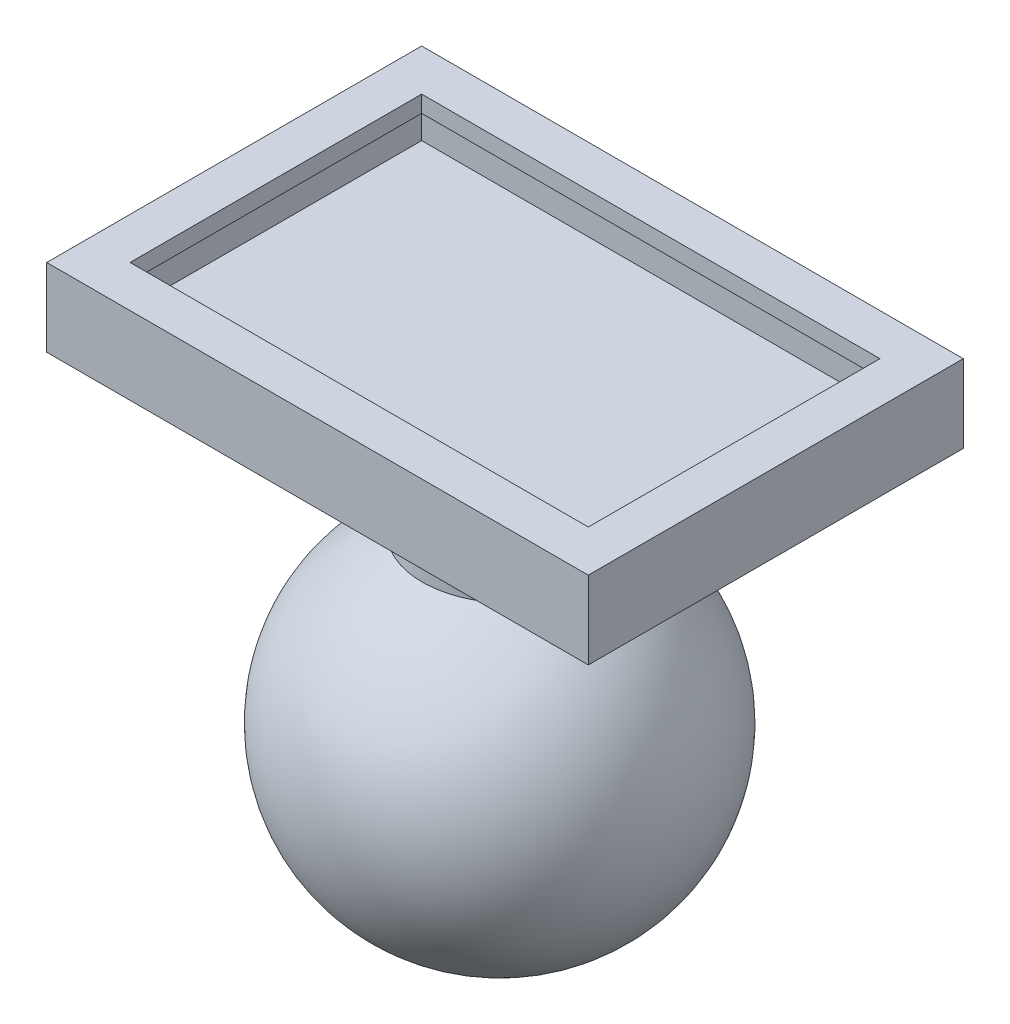
ISO-10303-21;
HEADER;
FILE_DESCRIPTION(('STEP AP214'),'2;1');
FILE_NAME('part.step','',(''),(''),'','','');
FILE_SCHEMA(('AUTOMOTIVE_DESIGN { 1 0 10303 214 1 1 1 1 }'));
ENDSEC;
DATA;
#1=APPLICATION_CONTEXT('core data for automotive mechanical design processes');
#2=APPLICATION_PROTOCOL_DEFINITION('international standard','automotive_design',2000,#1);
#3=PRODUCT_CONTEXT('',#1,'mechanical');
#4=PRODUCT('Part','Part','',(#3));
#5=PRODUCT_RELATED_PRODUCT_CATEGORY('part','',(#4));
#6=PRODUCT_DEFINITION_FORMATION('','',#4);
#7=PRODUCT_DEFINITION_CONTEXT('part definition',#1,'design');
#8=PRODUCT_DEFINITION('design','',#6,#7);
#9=PRODUCT_DEFINITION_SHAPE('','',#8);
#10=(LENGTH_UNIT() NAMED_UNIT(*) SI_UNIT(.MILLI.,.METRE.));
#11=(NAMED_UNIT(*) PLANE_ANGLE_UNIT() SI_UNIT($,.RADIAN.));
#12=(NAMED_UNIT(*) SI_UNIT($,.STERADIAN.) SOLID_ANGLE_UNIT());
#13=UNCERTAINTY_MEASURE_WITH_UNIT(LENGTH_MEASURE(1.E-05),#10,'distance_accuracy_value','');
#14=(GEOMETRIC_REPRESENTATION_CONTEXT(3) GLOBAL_UNCERTAINTY_ASSIGNED_CONTEXT((#13)) GLOBAL_UNIT_ASSIGNED_CONTEXT((#10,
#11,#12)) REPRESENTATION_CONTEXT('',''));
#15=CARTESIAN_POINT('',(0.,0.,0.));
#16=DIRECTION('',(0.,0.,1.));
#17=DIRECTION('',(1.,0.,0.));
#18=AXIS2_PLACEMENT_3D('',#15,#16,#17);
#19=CARTESIAN_POINT('',(0.,-4.4,0.));
#20=DIRECTION('',(0.,-1.,0.));
#21=DIRECTION('',(0.,0.,-1.));
#22=AXIS2_PLACEMENT_3D('',#19,#20,#21);
#23=PLANE('',#22);
#24=DIRECTION('',(0.,0.,-1.));
#25=VECTOR('',#24,1.);
#26=CARTESIAN_POINT('',(-2.99999999999999,-4.4,3.));
#27=LINE('',#26,#25);
#28=CARTESIAN_POINT('',(-2.99999999999999,-4.4,3.));
#29=VERTEX_POINT('',#28);
#30=CARTESIAN_POINT('',(-2.99999999999999,-4.4,-24.));
#31=VERTEX_POINT('',#30);
#32=EDGE_CURVE('E135',#29,#31,#27,.T.);
#33=ORIENTED_EDGE('',*,*,#32,.T.);
#34=DIRECTION('',(1.,0.,0.));
#35=VECTOR('',#34,1.);
#36=CARTESIAN_POINT('',(-2.99999999999999,-4.4,-24.));
#37=LINE('',#36,#35);
#38=CARTESIAN_POINT('',(36.,-4.4,-24.));
#39=VERTEX_POINT('',#38);
#40=EDGE_CURVE('E144',#31,#39,#37,.T.);
#41=ORIENTED_EDGE('',*,*,#40,.T.);
#42=DIRECTION('',(0.,0.,1.));
#43=VECTOR('',#42,1.);
#44=CARTESIAN_POINT('',(36.,-4.4,3.));
#45=LINE('',#44,#43);
#46=CARTESIAN_POINT('',(36.,-4.4,3.));
#47=VERTEX_POINT('',#46);
#48=EDGE_CURVE('E150',#39,#47,#45,.T.);
#49=ORIENTED_EDGE('',*,*,#48,.T.);
#50=DIRECTION('',(-1.,0.,0.));
#51=VECTOR('',#50,1.);
#52=CARTESIAN_POINT('',(-2.99999999999999,-4.4,3.));
#53=LINE('',#52,#51);
#54=EDGE_CURVE('E155',#47,#29,#53,.T.);
#55=ORIENTED_EDGE('',*,*,#54,.T.);
#56=EDGE_LOOP('',(#33,#41,#49,#55));
#57=FACE_BOUND('',#56,.T.);
#58=CARTESIAN_POINT('',(16.5,-4.4,-10.5));
#59=DIRECTION('',(0.,-1.,0.));
#60=DIRECTION('',(0.,0.,-1.));
#61=AXIS2_PLACEMENT_3D('',#58,#59,#60);
#62=CIRCLE('',#61,7.12302374541341);
#63=CARTESIAN_POINT('',(16.5,-4.4,-17.6230237454134));
#64=VERTEX_POINT('',#63);
#65=EDGE_CURVE('E159',#64,#64,#62,.T.);
#66=ORIENTED_EDGE('',*,*,#65,.F.);
#67=EDGE_LOOP('',(#66));
#68=FACE_BOUND('',#67,.T.);
#69=ADVANCED_FACE('F33',(#57,#68),#23,.T.);
#70=CARTESIAN_POINT('',(0.,1.2,0.));
#71=DIRECTION('',(0.,1.,0.));
#72=DIRECTION('',(0.,0.,1.));
#73=AXIS2_PLACEMENT_3D('',#70,#71,#72);
#74=PLANE('',#73);
#75=DIRECTION('',(0.,0.,1.));
#76=VECTOR('',#75,1.);
#77=CARTESIAN_POINT('',(-3.,1.2,-24.));
#78=LINE('',#77,#76);
#79=CARTESIAN_POINT('',(-3.,1.2,-24.));
#80=VERTEX_POINT('',#79);
#81=CARTESIAN_POINT('',(-2.99999999999999,1.2,3.));
#82=VERTEX_POINT('',#81);
#83=EDGE_CURVE('E137',#80,#82,#78,.T.);
#84=ORIENTED_EDGE('',*,*,#83,.T.);
#85=DIRECTION('',(1.,0.,0.));
#86=VECTOR('',#85,1.);
#87=CARTESIAN_POINT('',(-2.99999999999999,1.2,3.));
#88=LINE('',#87,#86);
#89=CARTESIAN_POINT('',(36.,1.2,3.));
#90=VERTEX_POINT('',#89);
#91=EDGE_CURVE('E226',#82,#90,#88,.T.);
#92=ORIENTED_EDGE('',*,*,#91,.T.);
#93=DIRECTION('',(0.,0.,-1.));
#94=VECTOR('',#93,1.);
#95=CARTESIAN_POINT('',(36.,1.2,-24.));
#96=LINE('',#95,#94);
#97=CARTESIAN_POINT('',(36.,1.2,-24.));
#98=VERTEX_POINT('',#97);
#99=EDGE_CURVE('E228',#90,#98,#96,.T.);
#100=ORIENTED_EDGE('',*,*,#99,.T.);
#101=DIRECTION('',(-1.,0.,0.));
#102=VECTOR('',#101,1.);
#103=CARTESIAN_POINT('',(-3.,1.2,-24.));
#104=LINE('',#103,#102);
#105=EDGE_CURVE('E141',#98,#80,#104,.T.);
#106=ORIENTED_EDGE('',*,*,#105,.T.);
#107=EDGE_LOOP('',(#84,#92,#100,#106));
#108=FACE_BOUND('',#107,.T.);
#109=DIRECTION('',(1.,0.,0.));
#110=VECTOR('',#109,1.);
#111=CARTESIAN_POINT('',(0.,1.2,0.));
#112=LINE('',#111,#110);
#113=CARTESIAN_POINT('',(0.,1.2,0.));
#114=VERTEX_POINT('',#113);
#115=CARTESIAN_POINT('',(33.,1.2,0.));
#116=VERTEX_POINT('',#115);
#117=EDGE_CURVE('E199',#114,#116,#112,.T.);
#118=ORIENTED_EDGE('',*,*,#117,.F.);
#119=DIRECTION('',(0.,0.,1.));
#120=VECTOR('',#119,1.);
#121=CARTESIAN_POINT('',(0.,1.2,0.));
#122=LINE('',#121,#120);
#123=CARTESIAN_POINT('',(0.,1.2,-21.));
#124=VERTEX_POINT('',#123);
#125=EDGE_CURVE('E197',#124,#114,#122,.T.);
#126=ORIENTED_EDGE('',*,*,#125,.F.);
#127=DIRECTION('',(-1.,0.,0.));
#128=VECTOR('',#127,1.);
#129=CARTESIAN_POINT('',(0.,1.2,-21.));
#130=LINE('',#129,#128);
#131=CARTESIAN_POINT('',(33.,1.2,-21.));
#132=VERTEX_POINT('',#131);
#133=EDGE_CURVE('E204',#132,#124,#130,.T.);
#134=ORIENTED_EDGE('',*,*,#133,.F.);
#135=DIRECTION('',(0.,0.,-1.));
#136=VECTOR('',#135,1.);
#137=CARTESIAN_POINT('',(33.,1.2,0.));
#138=LINE('',#137,#136);
#139=EDGE_CURVE('E202',#116,#132,#138,.T.);
#140=ORIENTED_EDGE('',*,*,#139,.F.);
#141=EDGE_LOOP('',(#118,#126,#134,#140));
#142=FACE_BOUND('',#141,.T.);
#143=ADVANCED_FACE('F239',(#108,#142),#74,.T.);
#144=CARTESIAN_POINT('',(0.,0.,0.));
#145=DIRECTION('',(0.,1.,0.));
#146=DIRECTION('',(0.,0.,1.));
#147=AXIS2_PLACEMENT_3D('',#144,#145,#146);
#148=PLANE('',#147);
#149=DIRECTION('',(-1.,0.,0.));
#150=VECTOR('',#149,1.);
#151=CARTESIAN_POINT('',(-1.5,0.,1.5));
#152=LINE('',#151,#150);
#153=CARTESIAN_POINT('',(34.5,0.,1.5));
#154=VERTEX_POINT('',#153);
#155=CARTESIAN_POINT('',(-1.5,0.,1.5));
#156=VERTEX_POINT('',#155);
#157=EDGE_CURVE('E170',#154,#156,#152,.T.);
#158=ORIENTED_EDGE('',*,*,#157,.T.);
#159=DIRECTION('',(0.,0.,-1.));
#160=VECTOR('',#159,1.);
#161=CARTESIAN_POINT('',(-1.5,0.,1.5));
#162=LINE('',#161,#160);
#163=CARTESIAN_POINT('',(-1.5,0.,-22.5));
#164=VERTEX_POINT('',#163);
#165=EDGE_CURVE('E165',#156,#164,#162,.T.);
#166=ORIENTED_EDGE('',*,*,#165,.T.);
#167=DIRECTION('',(1.,0.,0.));
#168=VECTOR('',#167,1.);
#169=CARTESIAN_POINT('',(-1.5,0.,-22.5));
#170=LINE('',#169,#168);
#171=CARTESIAN_POINT('',(34.5,0.,-22.5));
#172=VERTEX_POINT('',#171);
#173=EDGE_CURVE('E180',#164,#172,#170,.T.);
#174=ORIENTED_EDGE('',*,*,#173,.T.);
#175=DIRECTION('',(0.,0.,1.));
#176=VECTOR('',#175,1.);
#177=CARTESIAN_POINT('',(34.5,0.,1.5));
#178=LINE('',#177,#176);
#179=EDGE_CURVE('E183',#172,#154,#178,.T.);
#180=ORIENTED_EDGE('',*,*,#179,.T.);
#181=EDGE_LOOP('',(#158,#166,#174,#180));
#182=FACE_BOUND('',#181,.T.);
#183=DIRECTION('',(0.,0.,1.));
#184=VECTOR('',#183,1.);
#185=CARTESIAN_POINT('',(0.,0.,0.));
#186=LINE('',#185,#184);
#187=CARTESIAN_POINT('',(0.,0.,-21.));
#188=VERTEX_POINT('',#187);
#189=CARTESIAN_POINT('',(0.,0.,0.));
#190=VERTEX_POINT('',#189);
#191=EDGE_CURVE('E196',#188,#190,#186,.T.);
#192=ORIENTED_EDGE('',*,*,#191,.T.);
#193=DIRECTION('',(1.,0.,0.));
#194=VECTOR('',#193,1.);
#195=CARTESIAN_POINT('',(0.,0.,0.));
#196=LINE('',#195,#194);
#197=CARTESIAN_POINT('',(33.,0.,0.));
#198=VERTEX_POINT('',#197);
#199=EDGE_CURVE('E209',#190,#198,#196,.T.);
#200=ORIENTED_EDGE('',*,*,#199,.T.);
#201=DIRECTION('',(0.,0.,-1.));
#202=VECTOR('',#201,1.);
#203=CARTESIAN_POINT('',(33.,0.,0.));
#204=LINE('',#203,#202);
#205=CARTESIAN_POINT('',(33.,0.,-21.));
#206=VERTEX_POINT('',#205);
#207=EDGE_CURVE('E212',#198,#206,#204,.T.);
#208=ORIENTED_EDGE('',*,*,#207,.T.);
#209=DIRECTION('',(-1.,0.,0.));
#210=VECTOR('',#209,1.);
#211=CARTESIAN_POINT('',(0.,0.,-21.));
#212=LINE('',#211,#210);
#213=EDGE_CURVE('E200',#206,#188,#212,.T.);
#214=ORIENTED_EDGE('',*,*,#213,.T.);
#215=EDGE_LOOP('',(#192,#200,#208,#214));
#216=FACE_BOUND('',#215,.T.);
#217=ADVANCED_FACE('F257',(#182,#216),#148,.F.);
#218=CARTESIAN_POINT('',(-3.,1.2,-24.));
#219=DIRECTION('',(1.,0.,0.));
#220=DIRECTION('',(0.,0.,-1.));
#221=AXIS2_PLACEMENT_3D('',#218,#219,#220);
#222=PLANE('',#221);
#223=DIRECTION('',(0.,-1.,0.));
#224=VECTOR('',#223,1.);
#225=CARTESIAN_POINT('',(-3.,1.2,-24.));
#226=LINE('',#225,#224);
#227=EDGE_CURVE('E130',#80,#31,#226,.T.);
#228=ORIENTED_EDGE('',*,*,#227,.T.);
#229=ORIENTED_EDGE('',*,*,#32,.F.);
#230=DIRECTION('',(0.,-1.,0.));
#231=VECTOR('',#230,1.);
#232=CARTESIAN_POINT('',(-2.99999999999999,1.2,3.));
#233=LINE('',#232,#231);
#234=EDGE_CURVE('E46',#82,#29,#233,.T.);
#235=ORIENTED_EDGE('',*,*,#234,.F.);
#236=ORIENTED_EDGE('',*,*,#83,.F.);
#237=EDGE_LOOP('',(#228,#229,#235,#236));
#238=FACE_BOUND('',#237,.T.);
#239=ADVANCED_FACE('F132',(#238),#222,.F.);
#240=CARTESIAN_POINT('',(-2.99999999999999,1.2,3.));
#241=DIRECTION('',(0.,0.,-1.));
#242=DIRECTION('',(-1.,0.,0.));
#243=AXIS2_PLACEMENT_3D('',#240,#241,#242);
#244=PLANE('',#243);
#245=ORIENTED_EDGE('',*,*,#234,.T.);
#246=ORIENTED_EDGE('',*,*,#54,.F.);
#247=DIRECTION('',(0.,-1.,0.));
#248=VECTOR('',#247,1.);
#249=CARTESIAN_POINT('',(36.,1.2,3.));
#250=LINE('',#249,#248);
#251=EDGE_CURVE('E232',#90,#47,#250,.T.);
#252=ORIENTED_EDGE('',*,*,#251,.F.);
#253=ORIENTED_EDGE('',*,*,#91,.F.);
#254=EDGE_LOOP('',(#245,#246,#252,#253));
#255=FACE_BOUND('',#254,.T.);
#256=ADVANCED_FACE('F235',(#255),#244,.F.);
#257=CARTESIAN_POINT('',(36.,1.2,-24.));
#258=DIRECTION('',(-1.,0.,0.));
#259=DIRECTION('',(0.,0.,1.));
#260=AXIS2_PLACEMENT_3D('',#257,#258,#259);
#261=PLANE('',#260);
#262=ORIENTED_EDGE('',*,*,#251,.T.);
#263=ORIENTED_EDGE('',*,*,#48,.F.);
#264=DIRECTION('',(0.,-1.,0.));
#265=VECTOR('',#264,1.);
#266=CARTESIAN_POINT('',(36.,1.2,-24.));
#267=LINE('',#266,#265);
#268=EDGE_CURVE('E140',#98,#39,#267,.T.);
#269=ORIENTED_EDGE('',*,*,#268,.F.);
#270=ORIENTED_EDGE('',*,*,#99,.F.);
#271=EDGE_LOOP('',(#262,#263,#269,#270));
#272=FACE_BOUND('',#271,.T.);
#273=ADVANCED_FACE('F242',(#272),#261,.F.);
#274=CARTESIAN_POINT('',(-3.,1.2,-24.));
#275=DIRECTION('',(0.,0.,1.));
#276=DIRECTION('',(1.,0.,0.));
#277=AXIS2_PLACEMENT_3D('',#274,#275,#276);
#278=PLANE('',#277);
#279=ORIENTED_EDGE('',*,*,#268,.T.);
#280=ORIENTED_EDGE('',*,*,#40,.F.);
#281=ORIENTED_EDGE('',*,*,#227,.F.);
#282=ORIENTED_EDGE('',*,*,#105,.F.);
#283=EDGE_LOOP('',(#279,#280,#281,#282));
#284=FACE_BOUND('',#283,.T.);
#285=ADVANCED_FACE('F145',(#284),#278,.F.);
#286=CARTESIAN_POINT('',(0.,1.2,0.));
#287=DIRECTION('',(1.,0.,0.));
#288=DIRECTION('',(0.,0.,-1.));
#289=AXIS2_PLACEMENT_3D('',#286,#287,#288);
#290=PLANE('',#289);
#291=ORIENTED_EDGE('',*,*,#191,.F.);
#292=DIRECTION('',(0.,-1.,0.));
#293=VECTOR('',#292,1.);
#294=CARTESIAN_POINT('',(0.,1.2,-21.));
#295=LINE('',#294,#293);
#296=EDGE_CURVE('E206',#124,#188,#295,.T.);
#297=ORIENTED_EDGE('',*,*,#296,.F.);
#298=ORIENTED_EDGE('',*,*,#125,.T.);
#299=DIRECTION('',(0.,-1.,0.));
#300=VECTOR('',#299,1.);
#301=CARTESIAN_POINT('',(0.,1.2,0.));
#302=LINE('',#301,#300);
#303=EDGE_CURVE('E222',#114,#190,#302,.T.);
#304=ORIENTED_EDGE('',*,*,#303,.T.);
#305=EDGE_LOOP('',(#291,#297,#298,#304));
#306=FACE_BOUND('',#305,.T.);
#307=ADVANCED_FACE('F249',(#306),#290,.T.);
#308=CARTESIAN_POINT('',(0.,1.2,0.));
#309=DIRECTION('',(0.,0.,-1.));
#310=DIRECTION('',(-1.,0.,0.));
#311=AXIS2_PLACEMENT_3D('',#308,#309,#310);
#312=PLANE('',#311);
#313=ORIENTED_EDGE('',*,*,#199,.F.);
#314=ORIENTED_EDGE('',*,*,#303,.F.);
#315=ORIENTED_EDGE('',*,*,#117,.T.);
#316=DIRECTION('',(0.,-1.,0.));
#317=VECTOR('',#316,1.);
#318=CARTESIAN_POINT('',(33.,1.2,0.));
#319=LINE('',#318,#317);
#320=EDGE_CURVE('E220',#116,#198,#319,.T.);
#321=ORIENTED_EDGE('',*,*,#320,.T.);
#322=EDGE_LOOP('',(#313,#314,#315,#321));
#323=FACE_BOUND('',#322,.T.);
#324=ADVANCED_FACE('F289',(#323),#312,.T.);
#325=CARTESIAN_POINT('',(33.,1.2,0.));
#326=DIRECTION('',(-1.,0.,0.));
#327=DIRECTION('',(0.,0.,1.));
#328=AXIS2_PLACEMENT_3D('',#325,#326,#327);
#329=PLANE('',#328);
#330=ORIENTED_EDGE('',*,*,#207,.F.);
#331=ORIENTED_EDGE('',*,*,#320,.F.);
#332=ORIENTED_EDGE('',*,*,#139,.T.);
#333=DIRECTION('',(0.,-1.,0.));
#334=VECTOR('',#333,1.);
#335=CARTESIAN_POINT('',(33.,1.2,-21.));
#336=LINE('',#335,#334);
#337=EDGE_CURVE('E61',#132,#206,#336,.T.);
#338=ORIENTED_EDGE('',*,*,#337,.T.);
#339=EDGE_LOOP('',(#330,#331,#332,#338));
#340=FACE_BOUND('',#339,.T.);
#341=ADVANCED_FACE('F286',(#340),#329,.T.);
#342=CARTESIAN_POINT('',(0.,1.2,-21.));
#343=DIRECTION('',(0.,0.,1.));
#344=DIRECTION('',(1.,0.,0.));
#345=AXIS2_PLACEMENT_3D('',#342,#343,#344);
#346=PLANE('',#345);
#347=ORIENTED_EDGE('',*,*,#213,.F.);
#348=ORIENTED_EDGE('',*,*,#337,.F.);
#349=ORIENTED_EDGE('',*,*,#133,.T.);
#350=ORIENTED_EDGE('',*,*,#296,.T.);
#351=EDGE_LOOP('',(#347,#348,#349,#350));
#352=FACE_BOUND('',#351,.T.);
#353=ADVANCED_FACE('F282',(#352),#346,.T.);
#354=CARTESIAN_POINT('',(-1.5,-3.2,1.5));
#355=DIRECTION('',(1.,0.,0.));
#356=DIRECTION('',(0.,0.,-1.));
#357=AXIS2_PLACEMENT_3D('',#354,#355,#356);
#358=PLANE('',#357);
#359=ORIENTED_EDGE('',*,*,#165,.F.);
#360=DIRECTION('',(0.,1.,0.));
#361=VECTOR('',#360,1.);
#362=CARTESIAN_POINT('',(-1.5,-3.2,1.5));
#363=LINE('',#362,#361);
#364=CARTESIAN_POINT('',(-1.5,-3.2,1.5));
#365=VERTEX_POINT('',#364);
#366=EDGE_CURVE('E53',#365,#156,#363,.T.);
#367=ORIENTED_EDGE('',*,*,#366,.F.);
#368=DIRECTION('',(0.,0.,-1.));
#369=VECTOR('',#368,1.);
#370=CARTESIAN_POINT('',(-1.5,-3.2,1.5));
#371=LINE('',#370,#369);
#372=CARTESIAN_POINT('',(-1.5,-3.2,-22.5));
#373=VERTEX_POINT('',#372);
#374=EDGE_CURVE('E166',#365,#373,#371,.T.);
#375=ORIENTED_EDGE('',*,*,#374,.T.);
#376=DIRECTION('',(0.,1.,0.));
#377=VECTOR('',#376,1.);
#378=CARTESIAN_POINT('',(-1.5,-3.2,-22.5));
#379=LINE('',#378,#377);
#380=EDGE_CURVE('E193',#373,#164,#379,.T.);
#381=ORIENTED_EDGE('',*,*,#380,.T.);
#382=EDGE_LOOP('',(#359,#367,#375,#381));
#383=FACE_BOUND('',#382,.T.);
#384=ADVANCED_FACE('F278',(#383),#358,.T.);
#385=CARTESIAN_POINT('',(-1.5,-3.2,-22.5));
#386=DIRECTION('',(0.,0.,1.));
#387=DIRECTION('',(1.,0.,0.));
#388=AXIS2_PLACEMENT_3D('',#385,#386,#387);
#389=PLANE('',#388);
#390=ORIENTED_EDGE('',*,*,#173,.F.);
#391=ORIENTED_EDGE('',*,*,#380,.F.);
#392=DIRECTION('',(1.,0.,0.));
#393=VECTOR('',#392,1.);
#394=CARTESIAN_POINT('',(-1.5,-3.2,-22.5));
#395=LINE('',#394,#393);
#396=CARTESIAN_POINT('',(34.5,-3.2,-22.5));
#397=VERTEX_POINT('',#396);
#398=EDGE_CURVE('E169',#373,#397,#395,.T.);
#399=ORIENTED_EDGE('',*,*,#398,.T.);
#400=DIRECTION('',(0.,1.,0.));
#401=VECTOR('',#400,1.);
#402=CARTESIAN_POINT('',(34.5,-3.2,-22.5));
#403=LINE('',#402,#401);
#404=EDGE_CURVE('E191',#397,#172,#403,.T.);
#405=ORIENTED_EDGE('',*,*,#404,.T.);
#406=EDGE_LOOP('',(#390,#391,#399,#405));
#407=FACE_BOUND('',#406,.T.);
#408=ADVANCED_FACE('F274',(#407),#389,.T.);
#409=CARTESIAN_POINT('',(34.5,-3.2,1.5));
#410=DIRECTION('',(-1.,0.,0.));
#411=DIRECTION('',(0.,0.,1.));
#412=AXIS2_PLACEMENT_3D('',#409,#410,#411);
#413=PLANE('',#412);
#414=ORIENTED_EDGE('',*,*,#179,.F.);
#415=ORIENTED_EDGE('',*,*,#404,.F.);
#416=DIRECTION('',(0.,0.,1.));
#417=VECTOR('',#416,1.);
#418=CARTESIAN_POINT('',(34.5,-3.2,1.5));
#419=LINE('',#418,#417);
#420=CARTESIAN_POINT('',(34.5,-3.2,1.5));
#421=VERTEX_POINT('',#420);
#422=EDGE_CURVE('E173',#397,#421,#419,.T.);
#423=ORIENTED_EDGE('',*,*,#422,.T.);
#424=DIRECTION('',(0.,1.,0.));
#425=VECTOR('',#424,1.);
#426=CARTESIAN_POINT('',(34.5,-3.2,1.5));
#427=LINE('',#426,#425);
#428=EDGE_CURVE('E189',#421,#154,#427,.T.);
#429=ORIENTED_EDGE('',*,*,#428,.T.);
#430=EDGE_LOOP('',(#414,#415,#423,#429));
#431=FACE_BOUND('',#430,.T.);
#432=ADVANCED_FACE('F271',(#431),#413,.T.);
#433=CARTESIAN_POINT('',(-1.5,-3.2,1.5));
#434=DIRECTION('',(0.,0.,-1.));
#435=DIRECTION('',(-1.,0.,0.));
#436=AXIS2_PLACEMENT_3D('',#433,#434,#435);
#437=PLANE('',#436);
#438=ORIENTED_EDGE('',*,*,#157,.F.);
#439=ORIENTED_EDGE('',*,*,#428,.F.);
#440=DIRECTION('',(-1.,0.,0.));
#441=VECTOR('',#440,1.);
#442=CARTESIAN_POINT('',(-1.5,-3.2,1.5));
#443=LINE('',#442,#441);
#444=EDGE_CURVE('E176',#421,#365,#443,.T.);
#445=ORIENTED_EDGE('',*,*,#444,.T.);
#446=ORIENTED_EDGE('',*,*,#366,.T.);
#447=EDGE_LOOP('',(#438,#439,#445,#446));
#448=FACE_BOUND('',#447,.T.);
#449=ADVANCED_FACE('F267',(#448),#437,.T.);
#450=CARTESIAN_POINT('',(0.,-3.2,0.));
#451=DIRECTION('',(0.,-1.,0.));
#452=DIRECTION('',(0.,0.,-1.));
#453=AXIS2_PLACEMENT_3D('',#450,#451,#452);
#454=PLANE('',#453);
#455=ORIENTED_EDGE('',*,*,#374,.F.);
#456=ORIENTED_EDGE('',*,*,#444,.F.);
#457=ORIENTED_EDGE('',*,*,#422,.F.);
#458=ORIENTED_EDGE('',*,*,#398,.F.);
#459=EDGE_LOOP('',(#455,#456,#457,#458));
#460=FACE_BOUND('',#459,.T.);
#461=ADVANCED_FACE('F263',(#460),#454,.F.);
#462=CARTESIAN_POINT('',(16.5,-5.9,-10.5));
#463=DIRECTION('',(0.,1.,0.));
#464=DIRECTION('',(0.,0.,1.));
#465=AXIS2_PLACEMENT_3D('',#462,#463,#464);
#466=CYLINDRICAL_SURFACE('',#465,7.12302374541341);
#467=CARTESIAN_POINT('',(16.5,-4.70247143824048,-10.5));
#468=DIRECTION('',(0.,-1.,0.));
#469=DIRECTION('',(0.,0.,-1.));
#470=AXIS2_PLACEMENT_3D('',#467,#468,#469);
#471=CIRCLE('',#470,7.12302374541341);
#472=CARTESIAN_POINT('',(16.5,-4.70247143824048,-17.6230237454134));
#473=VERTEX_POINT('',#472);
#474=EDGE_CURVE('E11',#473,#473,#471,.F.);
#475=ORIENTED_EDGE('',*,*,#474,.T.);
#476=EDGE_LOOP('',(#475));
#477=FACE_BOUND('',#476,.T.);
#478=ORIENTED_EDGE('',*,*,#65,.T.);
#479=EDGE_LOOP('',(#478));
#480=FACE_BOUND('',#479,.T.);
#481=ADVANCED_FACE('F266',(#477,#480),#466,.T.);
#482=CARTESIAN_POINT('',(16.5,-24.4,-10.5));
#483=DIRECTION('',(0.,1.,0.));
#484=DIRECTION('',(0.,0.,1.));
#485=AXIS2_PLACEMENT_3D('',#482,#483,#484);
#486=CYLINDRICAL_SURFACE('',#485,6.);
#487=CARTESIAN_POINT('',(12.3401420971413,-12.9571910616867,-14.8238388300241));
#488=CARTESIAN_POINT('',(12.2186169662633,-12.9532080358993,-14.7069241861093));
#489=CARTESIAN_POINT('',(12.102040429852,-12.9491259413492,-14.5848977430095));
#490=CARTESIAN_POINT('',(11.8795425073728,-12.9407909992682,-14.3314242363047));
#491=CARTESIAN_POINT('',(11.7736239417402,-12.9365381069531,-14.1999746947275));
#492=CARTESIAN_POINT('',(11.5731494998244,-12.9278897415284,-13.9285045988563));
#493=CARTESIAN_POINT('',(11.47860387914,-12.9234941442022,-13.7884764779717));
#494=CARTESIAN_POINT('',(11.3016224219718,-12.9145939909644,-13.5008975406909));
#495=CARTESIAN_POINT('',(11.2191910287826,-12.9100893957763,-13.3533439906911));
#496=CARTESIAN_POINT('',(11.0671314109103,-12.9010090984403,-13.0519416774202));
#497=CARTESIAN_POINT('',(10.9974923215921,-12.8964334602461,-12.8980983931421));
#498=CARTESIAN_POINT('',(10.871401680252,-12.8872383517671,-12.5850343576879));
#499=CARTESIAN_POINT('',(10.8149549995918,-12.8826188659444,-12.4258116448923));
#500=CARTESIAN_POINT('',(10.7157142861903,-12.8733735421876,-12.1032750611352));
#501=CARTESIAN_POINT('',(10.6729118356242,-12.8687477099451,-11.9399637799666));
#502=CARTESIAN_POINT('',(10.6012028324424,-12.8595179686812,-11.6102544824924));
#503=CARTESIAN_POINT('',(10.5723014142543,-12.8549140683813,-11.4438553492024));
#504=CARTESIAN_POINT('',(10.52862733327,-12.8457632522437,-11.1092394094199));
#505=CARTESIAN_POINT('',(10.5138523560354,-12.841216327192,-10.9410229052492));
#506=CARTESIAN_POINT('',(10.4985255904763,-12.8322090872339,-10.6038784680245));
#507=CARTESIAN_POINT('',(10.4979790569082,-12.8277488049336,-10.4349502951768));
#508=CARTESIAN_POINT('',(10.511124991915,-12.8189494018275,-10.0977015570691));
#509=CARTESIAN_POINT('',(10.5248127678793,-12.8146102415755,-9.92938080991105));
#510=CARTESIAN_POINT('',(10.5663311512604,-12.8060803785859,-9.59442582553616));
#511=CARTESIAN_POINT('',(10.5941669779323,-12.8018897312458,-9.42779223386953));
#512=CARTESIAN_POINT('',(10.6637711296882,-12.793689841016,-9.09753960177872));
#513=CARTESIAN_POINT('',(10.7055327203901,-12.7896805115048,-8.93391914450844));
#514=CARTESIAN_POINT('',(10.80271107835,-12.7818676370868,-8.6107169935545));
#515=CARTESIAN_POINT('',(10.8581328819717,-12.7780641687109,-8.4511368134577));
#516=CARTESIAN_POINT('',(10.9822182462597,-12.7706921880035,-8.13726063482746));
#517=CARTESIAN_POINT('',(11.0508768717545,-12.7671235887673,-7.98296269205189));
#518=CARTESIAN_POINT('',(11.2009495629641,-12.7602441254828,-7.68067477833017));
#519=CARTESIAN_POINT('',(11.2823683275142,-12.7569333570539,-7.53268715675603));
#520=CARTESIAN_POINT('',(11.5448492481335,-12.7474279417928,-7.10000437125831));
#521=CARTESIAN_POINT('',(11.7443077142759,-12.741650019492,-6.82615616970091));
#522=CARTESIAN_POINT('',(12.186290638677,-12.7313834570877,-6.31598446764384));
#523=CARTESIAN_POINT('',(12.4288149346194,-12.726894812125,-6.07966082571953));
#524=CARTESIAN_POINT('',(12.9500527594013,-12.7193263976136,-5.65112440488008));
#525=CARTESIAN_POINT('',(13.2287532826203,-12.7162461235364,-5.45889584185552));
#526=CARTESIAN_POINT('',(13.8144727378215,-12.7115775858881,-5.1239623353399));
#527=CARTESIAN_POINT('',(14.1214916511195,-12.7099893213327,-4.98125735917398));
#528=CARTESIAN_POINT('',(14.7550485951908,-12.7083480408007,-4.74944454055657));
#529=CARTESIAN_POINT('',(15.0815812733558,-12.7082946057412,-4.66032207398471));
#530=CARTESIAN_POINT('',(15.7449687226944,-12.7097234672392,-4.53814772521825));
#531=CARTESIAN_POINT('',(16.0818234819228,-12.7112057620197,-4.50509577813904));
#532=CARTESIAN_POINT('',(16.7562678056578,-12.7156654514087,-4.49599653951288));
#533=CARTESIAN_POINT('',(17.0938573159032,-12.7186427391093,-4.51994517226998));
#534=CARTESIAN_POINT('',(17.7602144371428,-12.726011034128,-4.62415258730319));
#535=CARTESIAN_POINT('',(18.0889820422988,-12.7304020423816,-4.70441140684258));
#536=CARTESIAN_POINT('',(18.7284200111484,-12.7404783629457,-4.9189703977005));
#537=CARTESIAN_POINT('',(19.0390874833642,-12.7461638813446,-5.05327917649444));
#538=CARTESIAN_POINT('',(19.6334580211203,-12.7586726308265,-5.37211787589781));
#539=CARTESIAN_POINT('',(19.9171610449047,-12.7654958636712,-5.55664787427591));
#540=CARTESIAN_POINT('',(20.4496479768003,-12.7800941959073,-5.97075349337903));
#541=CARTESIAN_POINT('',(20.6984205575436,-12.7878696025498,-6.20034366877146));
#542=CARTESIAN_POINT('',(21.1538865195708,-12.8041548709499,-6.69801085561847));
#543=CARTESIAN_POINT('',(21.3605798152494,-12.8126647342016,-6.96608794536832));
#544=CARTESIAN_POINT('',(21.7260951170266,-12.8301846230074,-7.53322064337133));
#545=CARTESIAN_POINT('',(21.8849003030956,-12.8391948229849,-7.83228708676178));
#546=CARTESIAN_POINT('',(22.1500396164086,-12.8574595594104,-8.4528321116767));
#547=CARTESIAN_POINT('',(22.2563736701249,-12.8667140962007,-8.77431072460657));
#548=CARTESIAN_POINT('',(22.4135731796639,-12.8852078468112,-9.43063283067276));
#549=CARTESIAN_POINT('',(22.4644260729217,-12.8944470566883,-9.76547933290752));
#550=CARTESIAN_POINT('',(22.5091737080561,-12.9126447262203,-10.438965335914));
#551=CARTESIAN_POINT('',(22.5030684046306,-12.9216031856518,-10.7776048397023));
#552=CARTESIAN_POINT('',(22.4340708012482,-12.9389820689175,-11.4490603874414));
#553=CARTESIAN_POINT('',(22.3711784614601,-12.9474024923742,-11.7818764273076));
#554=CARTESIAN_POINT('',(22.1903714759541,-12.9634619106431,-12.4322428991621));
#555=CARTESIAN_POINT('',(22.0724569409401,-12.9711009070273,-12.7497933618632));
#556=CARTESIAN_POINT('',(21.7850270357184,-12.9853725790727,-13.360494464573));
#557=CARTESIAN_POINT('',(21.6155236130864,-12.9920054872035,-13.6536507340861));
#558=CARTESIAN_POINT('',(21.2295311731157,-13.0040754748337,-14.2074640628484));
#559=CARTESIAN_POINT('',(21.0130421606957,-13.0095125544582,-14.4681211254996));
#560=CARTESIAN_POINT('',(20.6580970221053,-13.0166451680078,-14.8288369287902));
#561=CARTESIAN_POINT('',(20.5346976413533,-13.0188528053709,-14.9440660093902));
#562=CARTESIAN_POINT('',(20.2786438343211,-13.0229130515286,-15.1637161038095));
#563=CARTESIAN_POINT('',(20.1459928460318,-13.024765791258,-15.2681410970876));
#564=CARTESIAN_POINT('',(19.8723202057854,-13.0281030407377,-15.4654749792751));
#565=CARTESIAN_POINT('',(19.7312954752997,-13.0295874140097,-15.5583795935705));
#566=CARTESIAN_POINT('',(19.4419678835983,-13.0321758289644,-15.7319469080177));
#567=CARTESIAN_POINT('',(19.2936677307298,-13.033280010968,-15.812614118582));
#568=CARTESIAN_POINT('',(18.9907900571385,-13.0351005655468,-15.9611737895068));
#569=CARTESIAN_POINT('',(18.8362122058633,-13.0358169176724,-16.0290655761138));
#570=CARTESIAN_POINT('',(18.5219435668318,-13.036856223074,-16.1515640244559));
#571=CARTESIAN_POINT('',(18.3622546891322,-13.0371793215924,-16.2061755850717));
#572=CARTESIAN_POINT('',(18.0387917834396,-13.0374302348507,-16.3017730981014));
#573=CARTESIAN_POINT('',(17.8750164291765,-13.0373579195532,-16.3427545633563));
#574=CARTESIAN_POINT('',(17.5446573549599,-13.0368183434804,-16.4107631561282));
#575=CARTESIAN_POINT('',(17.3780746940981,-13.0363512285181,-16.4377954296162));
#576=CARTESIAN_POINT('',(17.0432077923765,-13.0350256450324,-16.4777388049021));
#577=CARTESIAN_POINT('',(16.8749233663277,-13.0341671334585,-16.4906483527827));
#578=CARTESIAN_POINT('',(16.5379298461949,-13.0320655141303,-16.5022475539086));
#579=CARTESIAN_POINT('',(16.3692209316747,-13.030822548372,-16.5009424511774));
#580=CARTESIAN_POINT('',(16.0324108312719,-13.0279602536842,-16.4841297414968));
#581=CARTESIAN_POINT('',(15.8643100852508,-13.0263406927055,-16.4686133604901));
#582=CARTESIAN_POINT('',(15.5300785461656,-13.0227383106082,-16.4234853666819));
#583=CARTESIAN_POINT('',(15.363947050513,-13.0207556234699,-16.3938789461659));
#584=CARTESIAN_POINT('',(15.0346155938067,-13.0164392233575,-16.3207496740272));
#585=CARTESIAN_POINT('',(14.8714185452101,-13.0141051810984,-16.2772137243089));
#586=CARTESIAN_POINT('',(14.549338207787,-13.0091056555845,-16.1765637216638));
#587=CARTESIAN_POINT('',(14.3904533652361,-13.0064402936915,-16.1194546336082));
#588=CARTESIAN_POINT('',(14.07820118004,-13.0007995550587,-15.9921117904935));
#589=CARTESIAN_POINT('',(13.9248290513897,-12.9978244564205,-15.9218897648659));
#590=CARTESIAN_POINT('',(13.6245916837816,-12.9915852560122,-15.7688158094227));
#591=CARTESIAN_POINT('',(13.4777247448591,-12.9883212304224,-15.6859672046734));
#592=CARTESIAN_POINT('',(13.1559185618472,-12.9806827652056,-15.4861144543332));
#593=CARTESIAN_POINT('',(12.9830628756528,-12.9762338365984,-15.3657372099523));
#594=CARTESIAN_POINT('',(12.650953266642,-12.9669716539586,-15.1075030914455));
#595=CARTESIAN_POINT('',(12.4916993449068,-12.9621583998971,-14.9696462159301));
#596=CARTESIAN_POINT('',(12.3401420971413,-12.9571910616867,-14.8238388300241));
#597=B_SPLINE_CURVE_WITH_KNOTS('',3,(#487,#488,#489,#490,#491,#492,#493,#494,#495,#496,#497,
#498,#499,#500,#501,#502,#503,#504,#505,#506,#507,#508,#509,#510,#511,#512,#513,#514,#515,#516,
#517,#518,#519,#520,#521,#522,#523,#524,#525,#526,#527,#528,#529,#530,#531,#532,#533,#534,#535,
#536,#537,#538,#539,#540,#541,#542,#543,#544,#545,#546,#547,#548,#549,#550,#551,#552,#553,#554,
#555,#556,#557,#558,#559,#560,#561,#562,#563,#564,#565,#566,#567,#568,#569,#570,#571,#572,#573,
#574,#575,#576,#577,#578,#579,#580,#581,#582,#583,#584,#585,#586,#587,#588,#589,#590,#591,#592,
#593,#594,#595,#596),.UNSPECIFIED.,.T.,.F.,(4,2,2,2,2,2,2,2,2,2,2,2,2,2,2,2,2,2,2,2,2,2,2,2,2,2,
2,2,2,2,2,2,2,2,2,2,2,2,2,2,2,2,2,2,2,2,2,2,2,2,2,2,2,2,4),(0.,0.505858953352762,
1.01185142282377,1.51829680585707,2.02492748338574,2.5311258645061,3.03751086758638,
3.54358284843548,4.04984160666195,4.55601740658143,5.0623801414093,5.56857599704519,
6.07495872541908,6.58109692565699,7.08742201310381,7.59355868783179,8.09988218382243,
9.11114876920107,10.1224115431721,11.1333117624577,12.1442113147667,13.1548348397711,
14.1654571952848,15.1760072907322,16.1865580549121,17.1972698133877,18.2079831369817,
19.2190234650327,20.2300658499072,21.241462936779,22.2528614409153,23.2644889078911,
24.2761171794705,25.2877461606169,26.2993731063906,27.310765945464,28.3221586786624,
28.8282136503238,29.3340815586663,29.8401366101901,30.3460046864475,30.8518994338289,
31.3576072799997,31.8634814456644,32.3691688565486,32.8749119023971,33.3804683774548,
33.8863371941408,34.3920197385398,34.8981791863977,35.4041537721241,35.9096779164573,
36.415069166033,37.0459393743561,37.676809632827),.UNSPECIFIED.);
#598=CARTESIAN_POINT('',(12.3401420971413,-12.9571910616867,-14.8238388300241));
#599=VERTEX_POINT('',#598);
#600=EDGE_CURVE('E37',#599,#599,#597,.T.);
#601=ORIENTED_EDGE('',*,*,#600,.T.);
#602=EDGE_LOOP('',(#601));
#603=FACE_BOUND('',#602,.T.);
#604=CARTESIAN_POINT('',(16.5,-5.9,-10.5));
#605=DIRECTION('',(0.,-1.,0.));
#606=DIRECTION('',(0.,0.,-1.));
#607=AXIS2_PLACEMENT_3D('',#604,#605,#606);
#608=CIRCLE('',#607,6.);
#609=CARTESIAN_POINT('',(16.5,-5.9,-16.5));
#610=VERTEX_POINT('',#609);
#611=EDGE_CURVE('E156',#610,#610,#608,.T.);
#612=ORIENTED_EDGE('',*,*,#611,.T.);
#613=EDGE_LOOP('',(#612));
#614=FACE_BOUND('',#613,.T.);
#615=ADVANCED_FACE('F260',(#603,#614),#486,.T.);
#616=CARTESIAN_POINT('',(16.5,-4.70247143824048,-10.5));
#617=DIRECTION('',(0.,-1.,0.));
#618=DIRECTION('',(0.,0.,-1.));
#619=AXIS2_PLACEMENT_3D('',#616,#617,#618);
#620=TOROIDAL_SURFACE('',#619,5.92302374541341,1.2);
#621=ORIENTED_EDGE('',*,*,#474,.F.);
#622=EDGE_LOOP('',(#621));
#623=FACE_BOUND('',#622,.T.);
#624=ORIENTED_EDGE('',*,*,#611,.F.);
#625=EDGE_LOOP('',(#624));
#626=FACE_BOUND('',#625,.T.);
#627=ADVANCED_FACE('F35',(#623,#626),#620,.T.);
#628=CARTESIAN_POINT('',(16.4186059733982,-24.4,-10.1947724002431));
#629=DIRECTION('',(-0.983476121368674,0.,0.181037892988263));
#630=DIRECTION('',(0.181037892988263,0.,0.983476121368674));
#631=AXIS2_PLACEMENT_3D('',#628,#629,#630);
#632=SPHERICAL_SURFACE('',#631,13.);
#633=ORIENTED_EDGE('',*,*,#600,.F.);
#634=EDGE_LOOP('',(#633));
#635=FACE_BOUND('',#634,.T.);
#636=ADVANCED_FACE('F387',(#635),#632,.T.);
#637=CLOSED_SHELL('',(#69,#143,#217,#239,#256,#273,#285,#307,#324,#341,#353,#384,#408,#432,#449,
#461,#481,#615,#627,#636));
#638=MANIFOLD_SOLID_BREP('B2',#637);
#639=ADVANCED_BREP_SHAPE_REPRESENTATION('',(#18,#638),#14);
#640=SHAPE_DEFINITION_REPRESENTATION(#9,#639);
ENDSEC;
END-ISO-10303-21;
